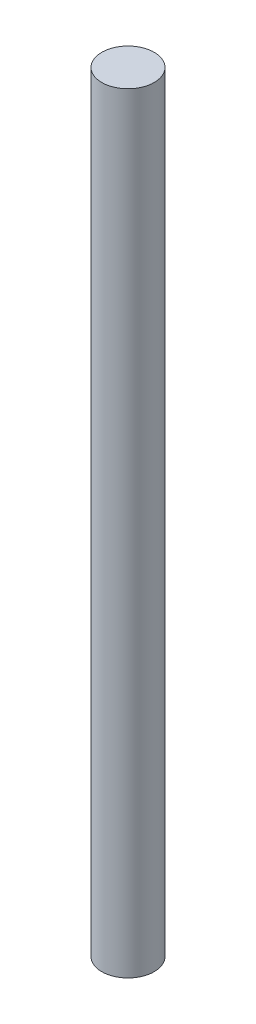
ISO-10303-21;
HEADER;
FILE_DESCRIPTION(('STEP AP214'),'2;1');
FILE_NAME('part.step','',(''),(''),'','','');
FILE_SCHEMA(('AUTOMOTIVE_DESIGN { 1 0 10303 214 1 1 1 1 }'));
ENDSEC;
DATA;
#1=APPLICATION_CONTEXT('core data for automotive mechanical design processes');
#2=APPLICATION_PROTOCOL_DEFINITION('international standard','automotive_design',2000,#1);
#3=PRODUCT_CONTEXT('',#1,'mechanical');
#4=PRODUCT('Part','Part','',(#3));
#5=PRODUCT_RELATED_PRODUCT_CATEGORY('part','',(#4));
#6=PRODUCT_DEFINITION_FORMATION('','',#4);
#7=PRODUCT_DEFINITION_CONTEXT('part definition',#1,'design');
#8=PRODUCT_DEFINITION('design','',#6,#7);
#9=PRODUCT_DEFINITION_SHAPE('','',#8);
#10=(LENGTH_UNIT() NAMED_UNIT(*) SI_UNIT(.MILLI.,.METRE.));
#11=(NAMED_UNIT(*) PLANE_ANGLE_UNIT() SI_UNIT($,.RADIAN.));
#12=(NAMED_UNIT(*) SI_UNIT($,.STERADIAN.) SOLID_ANGLE_UNIT());
#13=UNCERTAINTY_MEASURE_WITH_UNIT(LENGTH_MEASURE(1.E-05),#10,'distance_accuracy_value','');
#14=(GEOMETRIC_REPRESENTATION_CONTEXT(3) GLOBAL_UNCERTAINTY_ASSIGNED_CONTEXT((#13)) GLOBAL_UNIT_ASSIGNED_CONTEXT((#10,
#11,#12)) REPRESENTATION_CONTEXT('',''));
#15=CARTESIAN_POINT('',(0.,0.,0.));
#16=DIRECTION('',(0.,0.,1.));
#17=DIRECTION('',(1.,0.,0.));
#18=AXIS2_PLACEMENT_3D('',#15,#16,#17);
#19=CARTESIAN_POINT('',(0.,73.5,0.));
#20=DIRECTION('',(0.,-1.,0.));
#21=DIRECTION('',(0.,0.,-1.));
#22=AXIS2_PLACEMENT_3D('',#19,#20,#21);
#23=CYLINDRICAL_SURFACE('',#22,2.5);
#24=CARTESIAN_POINT('',(0.,73.5,0.));
#25=DIRECTION('',(0.,1.,0.));
#26=DIRECTION('',(0.,0.,1.));
#27=AXIS2_PLACEMENT_3D('',#24,#25,#26);
#28=CIRCLE('',#27,2.5);
#29=CARTESIAN_POINT('',(0.,73.5,2.5));
#30=VERTEX_POINT('',#29);
#31=EDGE_CURVE('E10',#30,#30,#28,.T.);
#32=ORIENTED_EDGE('',*,*,#31,.F.);
#33=EDGE_LOOP('',(#32));
#34=FACE_BOUND('',#33,.T.);
#35=CARTESIAN_POINT('',(0.,0.,0.));
#36=DIRECTION('',(0.,1.,0.));
#37=DIRECTION('',(0.,0.,1.));
#38=AXIS2_PLACEMENT_3D('',#35,#36,#37);
#39=CIRCLE('',#38,2.5);
#40=CARTESIAN_POINT('',(0.,0.,2.5));
#41=VERTEX_POINT('',#40);
#42=EDGE_CURVE('E44',#41,#41,#39,.T.);
#43=ORIENTED_EDGE('',*,*,#42,.T.);
#44=EDGE_LOOP('',(#43));
#45=FACE_BOUND('',#44,.T.);
#46=ADVANCED_FACE('F41',(#34,#45),#23,.T.);
#47=CARTESIAN_POINT('',(0.,73.5,0.));
#48=DIRECTION('',(0.,1.,0.));
#49=DIRECTION('',(0.,0.,1.));
#50=AXIS2_PLACEMENT_3D('',#47,#48,#49);
#51=PLANE('',#50);
#52=ORIENTED_EDGE('',*,*,#31,.T.);
#53=EDGE_LOOP('',(#52));
#54=FACE_BOUND('',#53,.T.);
#55=ADVANCED_FACE('F56',(#54),#51,.T.);
#56=CARTESIAN_POINT('',(0.,0.,0.));
#57=DIRECTION('',(0.,1.,0.));
#58=DIRECTION('',(0.,0.,1.));
#59=AXIS2_PLACEMENT_3D('',#56,#57,#58);
#60=PLANE('',#59);
#61=ORIENTED_EDGE('',*,*,#42,.F.);
#62=EDGE_LOOP('',(#61));
#63=FACE_BOUND('',#62,.T.);
#64=ADVANCED_FACE('F54',(#63),#60,.F.);
#65=CLOSED_SHELL('',(#46,#55,#64));
#66=MANIFOLD_SOLID_BREP('B2',#65);
#67=ADVANCED_BREP_SHAPE_REPRESENTATION('',(#18,#66),#14);
#68=SHAPE_DEFINITION_REPRESENTATION(#9,#67);
ENDSEC;
END-ISO-10303-21;
